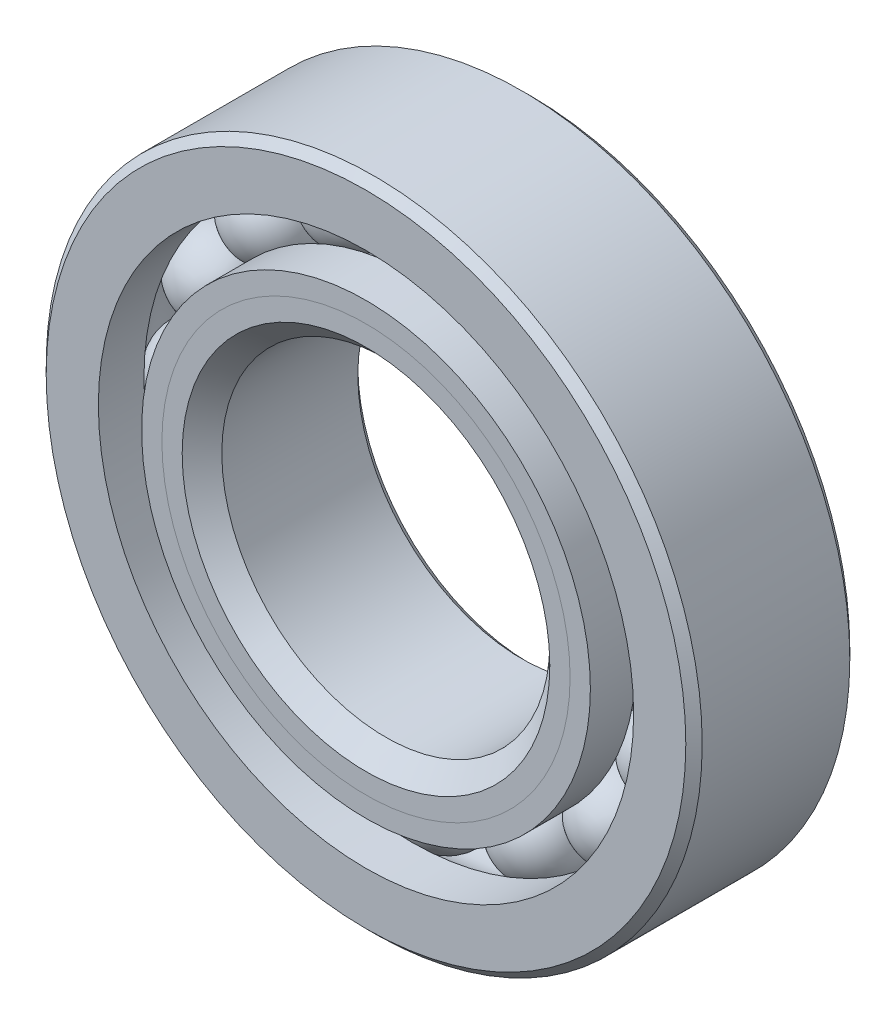
ISO-10303-21;
HEADER;
FILE_DESCRIPTION(('STEP AP214'),'2;1');
FILE_NAME('part.step','',(''),(''),'','','');
FILE_SCHEMA(('AUTOMOTIVE_DESIGN { 1 0 10303 214 1 1 1 1 }'));
ENDSEC;
DATA;
#1=APPLICATION_CONTEXT('core data for automotive mechanical design processes');
#2=APPLICATION_PROTOCOL_DEFINITION('international standard','automotive_design',2000,#1);
#3=PRODUCT_CONTEXT('',#1,'mechanical');
#4=PRODUCT('Part','Part','',(#3));
#5=PRODUCT_RELATED_PRODUCT_CATEGORY('part','',(#4));
#6=PRODUCT_DEFINITION_FORMATION('','',#4);
#7=PRODUCT_DEFINITION_CONTEXT('part definition',#1,'design');
#8=PRODUCT_DEFINITION('design','',#6,#7);
#9=PRODUCT_DEFINITION_SHAPE('','',#8);
#10=(LENGTH_UNIT() NAMED_UNIT(*) SI_UNIT(.MILLI.,.METRE.));
#11=(NAMED_UNIT(*) PLANE_ANGLE_UNIT() SI_UNIT($,.RADIAN.));
#12=(NAMED_UNIT(*) SI_UNIT($,.STERADIAN.) SOLID_ANGLE_UNIT());
#13=UNCERTAINTY_MEASURE_WITH_UNIT(LENGTH_MEASURE(1.E-05),#10,'distance_accuracy_value','');
#14=(GEOMETRIC_REPRESENTATION_CONTEXT(3) GLOBAL_UNCERTAINTY_ASSIGNED_CONTEXT((#13)) GLOBAL_UNIT_ASSIGNED_CONTEXT((#10,
#11,#12)) REPRESENTATION_CONTEXT('',''));
#15=CARTESIAN_POINT('',(0.,0.,0.));
#16=DIRECTION('',(0.,0.,1.));
#17=DIRECTION('',(1.,0.,0.));
#18=AXIS2_PLACEMENT_3D('',#15,#16,#17);
#19=CARTESIAN_POINT('',(-7.29011938655472,17.5999050943401,0.));
#20=DIRECTION('',(0.,0.,1.));
#21=DIRECTION('',(-0.382683432365077,0.923879532511292,0.));
#22=AXIS2_PLACEMENT_3D('',#19,#20,#21);
#23=SPHERICAL_SURFACE('',#22,3.28171342706955);
#24=CARTESIAN_POINT('',(-7.29011938655472,17.5999050943401,3.28171342706955));
#25=VERTEX_POINT('',#24);
#26=VERTEX_LOOP('',#25);
#27=FACE_BOUND('',#26,.T.);
#28=ADVANCED_FACE('F44',(#27),#23,.T.);
#29=CLOSED_SHELL('',(#28));
#30=MANIFOLD_SOLID_BREP('B2',#29);
#31=CARTESIAN_POINT('',(-13.4703841816036,13.4703841816039,0.));
#32=DIRECTION('',(0.,0.,1.));
#33=DIRECTION('',(-0.707106781186539,0.707106781186556,0.));
#34=AXIS2_PLACEMENT_3D('',#31,#32,#33);
#35=SPHERICAL_SURFACE('',#34,3.28171342706955);
#36=CARTESIAN_POINT('',(-13.4703841816036,13.4703841816039,3.28171342706955));
#37=VERTEX_POINT('',#36);
#38=VERTEX_LOOP('',#37);
#39=FACE_BOUND('',#38,.T.);
#40=ADVANCED_FACE('F77',(#39),#35,.T.);
#41=CLOSED_SHELL('',(#40));
#42=MANIFOLD_SOLID_BREP('B6',#41);
#43=CARTESIAN_POINT('',(-17.5999050943399,7.29011938655515,0.));
#44=DIRECTION('',(0.,0.,1.));
#45=DIRECTION('',(-0.923879532511283,0.3826834323651,0.));
#46=AXIS2_PLACEMENT_3D('',#43,#44,#45);
#47=SPHERICAL_SURFACE('',#46,3.28171342706955);
#48=CARTESIAN_POINT('',(-17.5999050943399,7.29011938655515,3.28171342706955));
#49=VERTEX_POINT('',#48);
#50=VERTEX_LOOP('',#49);
#51=FACE_BOUND('',#50,.T.);
#52=ADVANCED_FACE('F110',(#51),#47,.T.);
#53=CLOSED_SHELL('',(#52));
#54=MANIFOLD_SOLID_BREP('B40',#53);
#55=CARTESIAN_POINT('',(-19.05,1.99538158514885E-13,0.));
#56=DIRECTION('',(0.,0.,1.));
#57=DIRECTION('',(-1.,0.,0.));
#58=AXIS2_PLACEMENT_3D('',#55,#56,#57);
#59=SPHERICAL_SURFACE('',#58,3.28171342706955);
#60=CARTESIAN_POINT('',(-19.05,1.99538158514885E-13,3.28171342706955));
#61=VERTEX_POINT('',#60);
#62=VERTEX_LOOP('',#61);
#63=FACE_BOUND('',#62,.T.);
#64=ADVANCED_FACE('F143',(#63),#59,.T.);
#65=CLOSED_SHELL('',(#64));
#66=MANIFOLD_SOLID_BREP('B73',#65);
#67=CARTESIAN_POINT('',(-17.5999050943401,-7.29011938655478,0.));
#68=DIRECTION('',(0.,0.,1.));
#69=DIRECTION('',(-0.923879532511291,-0.382683432365081,0.));
#70=AXIS2_PLACEMENT_3D('',#67,#68,#69);
#71=SPHERICAL_SURFACE('',#70,3.28171342706955);
#72=CARTESIAN_POINT('',(-17.5999050943401,-7.29011938655478,3.28171342706955));
#73=VERTEX_POINT('',#72);
#74=VERTEX_LOOP('',#73);
#75=FACE_BOUND('',#74,.T.);
#76=ADVANCED_FACE('F176',(#75),#71,.T.);
#77=CLOSED_SHELL('',(#76));
#78=MANIFOLD_SOLID_BREP('B106',#77);
#79=CARTESIAN_POINT('',(-13.4703841816038,-13.4703841816036,0.));
#80=DIRECTION('',(0.,0.,1.));
#81=DIRECTION('',(-0.707106781186554,-0.707106781186541,0.));
#82=AXIS2_PLACEMENT_3D('',#79,#80,#81);
#83=SPHERICAL_SURFACE('',#82,3.28171342706955);
#84=CARTESIAN_POINT('',(-13.4703841816038,-13.4703841816036,3.28171342706955));
#85=VERTEX_POINT('',#84);
#86=VERTEX_LOOP('',#85);
#87=FACE_BOUND('',#86,.T.);
#88=ADVANCED_FACE('F209',(#87),#83,.T.);
#89=CLOSED_SHELL('',(#88));
#90=MANIFOLD_SOLID_BREP('B139',#89);
#91=CARTESIAN_POINT('',(-7.2901193865551,-17.59990509434,0.));
#92=DIRECTION('',(0.,0.,1.));
#93=DIRECTION('',(-0.382683432365097,-0.923879532511284,0.));
#94=AXIS2_PLACEMENT_3D('',#91,#92,#93);
#95=SPHERICAL_SURFACE('',#94,3.28171342706955);
#96=CARTESIAN_POINT('',(-7.2901193865551,-17.59990509434,3.28171342706955));
#97=VERTEX_POINT('',#96);
#98=VERTEX_LOOP('',#97);
#99=FACE_BOUND('',#98,.T.);
#100=ADVANCED_FACE('F242',(#99),#95,.T.);
#101=CLOSED_SHELL('',(#100));
#102=MANIFOLD_SOLID_BREP('B172',#101);
#103=CARTESIAN_POINT('',(-1.33025439009923E-13,-19.05,0.));
#104=DIRECTION('',(0.,0.,1.));
#105=DIRECTION('',(0.,-1.,0.));
#106=AXIS2_PLACEMENT_3D('',#103,#104,#105);
#107=SPHERICAL_SURFACE('',#106,3.28171342706955);
#108=CARTESIAN_POINT('',(-1.33025439009923E-13,-19.05,3.28171342706955));
#109=VERTEX_POINT('',#108);
#110=VERTEX_LOOP('',#109);
#111=FACE_BOUND('',#110,.T.);
#112=ADVANCED_FACE('F275',(#111),#107,.T.);
#113=CLOSED_SHELL('',(#112));
#114=MANIFOLD_SOLID_BREP('B205',#113);
#115=CARTESIAN_POINT('',(7.29011938655485,-17.5999050943401,0.));
#116=DIRECTION('',(0.,0.,1.));
#117=DIRECTION('',(0.382683432365084,-0.923879532511289,0.));
#118=AXIS2_PLACEMENT_3D('',#115,#116,#117);
#119=SPHERICAL_SURFACE('',#118,3.28171342706955);
#120=CARTESIAN_POINT('',(7.29011938655485,-17.5999050943401,3.28171342706955));
#121=VERTEX_POINT('',#120);
#122=VERTEX_LOOP('',#121);
#123=FACE_BOUND('',#122,.T.);
#124=ADVANCED_FACE('F308',(#123),#119,.T.);
#125=CLOSED_SHELL('',(#124));
#126=MANIFOLD_SOLID_BREP('B238',#125);
#127=CARTESIAN_POINT('',(13.4703841816037,-13.4703841816038,0.));
#128=DIRECTION('',(0.,0.,1.));
#129=DIRECTION('',(0.707106781186544,-0.707106781186551,0.));
#130=AXIS2_PLACEMENT_3D('',#127,#128,#129);
#131=SPHERICAL_SURFACE('',#130,3.28171342706955);
#132=CARTESIAN_POINT('',(13.4703841816037,-13.4703841816038,3.28171342706955));
#133=VERTEX_POINT('',#132);
#134=VERTEX_LOOP('',#133);
#135=FACE_BOUND('',#134,.T.);
#136=ADVANCED_FACE('F341',(#135),#131,.T.);
#137=CLOSED_SHELL('',(#136));
#138=MANIFOLD_SOLID_BREP('B271',#137);
#139=CARTESIAN_POINT('',(17.59990509434,-7.29011938655504,0.));
#140=DIRECTION('',(0.,0.,1.));
#141=DIRECTION('',(0.923879532511285,-0.382683432365094,0.));
#142=AXIS2_PLACEMENT_3D('',#139,#140,#141);
#143=SPHERICAL_SURFACE('',#142,3.28171342706955);
#144=CARTESIAN_POINT('',(17.59990509434,-7.29011938655504,3.28171342706955));
#145=VERTEX_POINT('',#144);
#146=VERTEX_LOOP('',#145);
#147=FACE_BOUND('',#146,.T.);
#148=ADVANCED_FACE('F374',(#147),#143,.T.);
#149=CLOSED_SHELL('',(#148));
#150=MANIFOLD_SOLID_BREP('B304',#149);
#151=CARTESIAN_POINT('',(19.05,0.,0.));
#152=DIRECTION('',(0.,0.,1.));
#153=DIRECTION('',(1.,0.,0.));
#154=AXIS2_PLACEMENT_3D('',#151,#152,#153);
#155=SPHERICAL_SURFACE('',#154,3.28171342706955);
#156=CARTESIAN_POINT('',(19.05,0.,3.28171342706955));
#157=VERTEX_POINT('',#156);
#158=VERTEX_LOOP('',#157);
#159=FACE_BOUND('',#158,.T.);
#160=ADVANCED_FACE('F407',(#159),#155,.T.);
#161=CLOSED_SHELL('',(#160));
#162=MANIFOLD_SOLID_BREP('B337',#161);
#163=CARTESIAN_POINT('',(17.59990509434,7.29011938655491,0.));
#164=DIRECTION('',(0.,0.,1.));
#165=DIRECTION('',(0.923879532511288,0.382683432365087,0.));
#166=AXIS2_PLACEMENT_3D('',#163,#164,#165);
#167=SPHERICAL_SURFACE('',#166,3.28171342706955);
#168=CARTESIAN_POINT('',(17.59990509434,7.29011938655491,3.28171342706955));
#169=VERTEX_POINT('',#168);
#170=VERTEX_LOOP('',#169);
#171=FACE_BOUND('',#170,.T.);
#172=ADVANCED_FACE('F440',(#171),#167,.T.);
#173=CLOSED_SHELL('',(#172));
#174=MANIFOLD_SOLID_BREP('B370',#173);
#175=CARTESIAN_POINT('',(13.4703841816038,13.4703841816037,0.));
#176=DIRECTION('',(0.,0.,1.));
#177=DIRECTION('',(0.707106781186549,0.707106781186546,0.));
#178=AXIS2_PLACEMENT_3D('',#175,#176,#177);
#179=SPHERICAL_SURFACE('',#178,3.28171342706955);
#180=CARTESIAN_POINT('',(13.4703841816038,13.4703841816037,3.28171342706955));
#181=VERTEX_POINT('',#180);
#182=VERTEX_LOOP('',#181);
#183=FACE_BOUND('',#182,.T.);
#184=ADVANCED_FACE('F473',(#183),#179,.T.);
#185=CLOSED_SHELL('',(#184));
#186=MANIFOLD_SOLID_BREP('B403',#185);
#187=CARTESIAN_POINT('',(7.29011938655498,17.59990509434,0.));
#188=DIRECTION('',(0.,0.,1.));
#189=DIRECTION('',(0.382683432365091,0.923879532511287,0.));
#190=AXIS2_PLACEMENT_3D('',#187,#188,#189);
#191=SPHERICAL_SURFACE('',#190,3.28171342706955);
#192=CARTESIAN_POINT('',(7.29011938655498,17.59990509434,3.28171342706955));
#193=VERTEX_POINT('',#192);
#194=VERTEX_LOOP('',#193);
#195=FACE_BOUND('',#194,.T.);
#196=ADVANCED_FACE('F506',(#195),#191,.T.);
#197=CLOSED_SHELL('',(#196));
#198=MANIFOLD_SOLID_BREP('B436',#197);
#199=CARTESIAN_POINT('',(0.,19.05,0.));
#200=DIRECTION('',(0.,0.,1.));
#201=DIRECTION('',(0.,1.,0.));
#202=AXIS2_PLACEMENT_3D('',#199,#200,#201);
#203=SPHERICAL_SURFACE('',#202,3.28171342706955);
#204=CARTESIAN_POINT('',(0.,19.05,3.28171342706955));
#205=VERTEX_POINT('',#204);
#206=VERTEX_LOOP('',#205);
#207=FACE_BOUND('',#206,.T.);
#208=ADVANCED_FACE('F541',(#207),#203,.T.);
#209=CLOSED_SHELL('',(#208));
#210=MANIFOLD_SOLID_BREP('B469',#209);
#211=CARTESIAN_POINT('',(0.,15.80470900587,6.35));
#212=DIRECTION('',(0.,0.,-1.));
#213=DIRECTION('',(-1.,0.,0.));
#214=AXIS2_PLACEMENT_3D('',#211,#212,#213);
#215=PLANE('',#214);
#216=CARTESIAN_POINT('',(0.,0.,6.35));
#217=DIRECTION('',(0.,0.,1.));
#218=DIRECTION('',(1.,0.,0.));
#219=AXIS2_PLACEMENT_3D('',#216,#217,#218);
#220=CIRCLE('',#219,14.2341432864652);
#221=CARTESIAN_POINT('',(14.2341432864652,0.,6.35));
#222=VERTEX_POINT('',#221);
#223=EDGE_CURVE('E601',#222,#222,#220,.T.);
#224=ORIENTED_EDGE('',*,*,#223,.F.);
#225=EDGE_LOOP('',(#224));
#226=FACE_BOUND('',#225,.T.);
#227=CARTESIAN_POINT('',(0.,0.,6.35));
#228=DIRECTION('',(0.,0.,1.));
#229=DIRECTION('',(1.,0.,0.));
#230=AXIS2_PLACEMENT_3D('',#227,#228,#229);
#231=CIRCLE('',#230,15.80470900587);
#232=CARTESIAN_POINT('',(15.80470900587,0.,6.35));
#233=VERTEX_POINT('',#232);
#234=EDGE_CURVE('E540',#233,#233,#231,.T.);
#235=ORIENTED_EDGE('',*,*,#234,.T.);
#236=EDGE_LOOP('',(#235));
#237=FACE_BOUND('',#236,.T.);
#238=ADVANCED_FACE('F562',(#226,#237),#215,.F.);
#239=CARTESIAN_POINT('',(0.,0.,4.77943428059526));
#240=DIRECTION('',(0.,0.,1.));
#241=DIRECTION('',(1.,0.,0.));
#242=AXIS2_PLACEMENT_3D('',#239,#240,#241);
#243=CONICAL_SURFACE('',#242,14.2341432864652,0.78539816339745);
#244=ORIENTED_EDGE('',*,*,#234,.F.);
#245=EDGE_LOOP('',(#244));
#246=FACE_BOUND('',#245,.T.);
#247=CARTESIAN_POINT('',(0.,0.,4.77943428059526));
#248=DIRECTION('',(0.,0.,1.));
#249=DIRECTION('',(1.,0.,0.));
#250=AXIS2_PLACEMENT_3D('',#247,#248,#249);
#251=CIRCLE('',#250,14.2341432864652);
#252=CARTESIAN_POINT('',(14.2341432864652,0.,4.77943428059526));
#253=VERTEX_POINT('',#252);
#254=EDGE_CURVE('E568',#253,#253,#251,.T.);
#255=ORIENTED_EDGE('',*,*,#254,.T.);
#256=EDGE_LOOP('',(#255));
#257=FACE_BOUND('',#256,.T.);
#258=ADVANCED_FACE('F608',(#246,#257),#243,.T.);
#259=CARTESIAN_POINT('',(0.,0.,6.35));
#260=DIRECTION('',(0.,0.,1.));
#261=DIRECTION('',(1.,0.,0.));
#262=AXIS2_PLACEMENT_3D('',#259,#260,#261);
#263=CYLINDRICAL_SURFACE('',#262,14.2341432864652);
#264=ORIENTED_EDGE('',*,*,#254,.F.);
#265=EDGE_LOOP('',(#264));
#266=FACE_BOUND('',#265,.T.);
#267=CARTESIAN_POINT('',(0.,0.,0.));
#268=DIRECTION('',(0.,0.,1.));
#269=DIRECTION('',(1.,0.,0.));
#270=AXIS2_PLACEMENT_3D('',#267,#268,#269);
#271=CIRCLE('',#270,14.2341432864652);
#272=CARTESIAN_POINT('',(14.2341432864652,0.,0.));
#273=VERTEX_POINT('',#272);
#274=EDGE_CURVE('E572',#273,#273,#271,.T.);
#275=ORIENTED_EDGE('',*,*,#274,.T.);
#276=EDGE_LOOP('',(#275));
#277=FACE_BOUND('',#276,.T.);
#278=ADVANCED_FACE('F612',(#266,#277),#263,.T.);
#279=CARTESIAN_POINT('',(0.,14.2341432864652,0.));
#280=DIRECTION('',(0.,0.,-1.));
#281=DIRECTION('',(-1.,0.,0.));
#282=AXIS2_PLACEMENT_3D('',#279,#280,#281);
#283=PLANE('',#282);
#284=ORIENTED_EDGE('',*,*,#274,.F.);
#285=EDGE_LOOP('',(#284));
#286=FACE_BOUND('',#285,.T.);
#287=CARTESIAN_POINT('',(0.,0.,0.));
#288=DIRECTION('',(0.,0.,1.));
#289=DIRECTION('',(1.,0.,0.));
#290=AXIS2_PLACEMENT_3D('',#287,#288,#289);
#291=CIRCLE('',#290,15.7682865729304);
#292=CARTESIAN_POINT('',(15.7682865729304,0.,0.));
#293=VERTEX_POINT('',#292);
#294=EDGE_CURVE('E577',#293,#293,#291,.T.);
#295=ORIENTED_EDGE('',*,*,#294,.T.);
#296=EDGE_LOOP('',(#295));
#297=FACE_BOUND('',#296,.T.);
#298=ADVANCED_FACE('F617',(#286,#297),#283,.F.);
#299=CARTESIAN_POINT('',(0.,0.,0.));
#300=DIRECTION('',(0.,0.,1.));
#301=DIRECTION('',(1.,0.,0.));
#302=AXIS2_PLACEMENT_3D('',#299,#300,#301);
#303=TOROIDAL_SURFACE('',#302,19.05,3.28171342706955);
#304=ORIENTED_EDGE('',*,*,#294,.F.);
#305=EDGE_LOOP('',(#304));
#306=FACE_BOUND('',#305,.T.);
#307=CARTESIAN_POINT('',(0.,0.,-2.82222222222222));
#308=DIRECTION('',(0.,0.,1.));
#309=DIRECTION('',(1.,0.,0.));
#310=AXIS2_PLACEMENT_3D('',#307,#308,#309);
#311=CIRCLE('',#310,17.3752747252747);
#312=CARTESIAN_POINT('',(17.3752747252747,0.,-2.82222222222222));
#313=VERTEX_POINT('',#312);
#314=EDGE_CURVE('E583',#313,#313,#311,.T.);
#315=ORIENTED_EDGE('',*,*,#314,.T.);
#316=EDGE_LOOP('',(#315));
#317=FACE_BOUND('',#316,.T.);
#318=ADVANCED_FACE('F623',(#306,#317),#303,.F.);
#319=CARTESIAN_POINT('',(0.,0.,6.35));
#320=DIRECTION('',(0.,0.,1.));
#321=DIRECTION('',(1.,0.,0.));
#322=AXIS2_PLACEMENT_3D('',#319,#320,#321);
#323=CYLINDRICAL_SURFACE('',#322,17.3752747252747);
#324=ORIENTED_EDGE('',*,*,#314,.F.);
#325=EDGE_LOOP('',(#324));
#326=FACE_BOUND('',#325,.T.);
#327=CARTESIAN_POINT('',(0.,0.,-6.35));
#328=DIRECTION('',(0.,0.,1.));
#329=DIRECTION('',(1.,0.,0.));
#330=AXIS2_PLACEMENT_3D('',#327,#328,#329);
#331=CIRCLE('',#330,17.3752747252747);
#332=CARTESIAN_POINT('',(17.3752747252747,0.,-6.35));
#333=VERTEX_POINT('',#332);
#334=EDGE_CURVE('E587',#333,#333,#331,.T.);
#335=ORIENTED_EDGE('',*,*,#334,.T.);
#336=EDGE_LOOP('',(#335));
#337=FACE_BOUND('',#336,.T.);
#338=ADVANCED_FACE('F627',(#326,#337),#323,.T.);
#339=CARTESIAN_POINT('',(0.,13.335,-6.35));
#340=DIRECTION('',(0.,0.,1.));
#341=DIRECTION('',(1.,0.,0.));
#342=AXIS2_PLACEMENT_3D('',#339,#340,#341);
#343=PLANE('',#342);
#344=ORIENTED_EDGE('',*,*,#334,.F.);
#345=EDGE_LOOP('',(#344));
#346=FACE_BOUND('',#345,.T.);
#347=CARTESIAN_POINT('',(0.,0.,-6.35));
#348=DIRECTION('',(0.,0.,1.));
#349=DIRECTION('',(1.,0.,0.));
#350=AXIS2_PLACEMENT_3D('',#347,#348,#349);
#351=CIRCLE('',#350,13.335);
#352=CARTESIAN_POINT('',(13.335,0.,-6.35));
#353=VERTEX_POINT('',#352);
#354=EDGE_CURVE('E591',#353,#353,#351,.T.);
#355=ORIENTED_EDGE('',*,*,#354,.T.);
#356=EDGE_LOOP('',(#355));
#357=FACE_BOUND('',#356,.T.);
#358=ADVANCED_FACE('F631',(#346,#357),#343,.F.);
#359=CARTESIAN_POINT('',(0.,0.,-5.715));
#360=DIRECTION('',(0.,0.,-1.));
#361=DIRECTION('',(-1.,0.,0.));
#362=AXIS2_PLACEMENT_3D('',#359,#360,#361);
#363=CONICAL_SURFACE('',#362,12.7,0.785398163397444);
#364=ORIENTED_EDGE('',*,*,#354,.F.);
#365=EDGE_LOOP('',(#364));
#366=FACE_BOUND('',#365,.T.);
#367=CARTESIAN_POINT('',(0.,0.,-5.715));
#368=DIRECTION('',(0.,0.,1.));
#369=DIRECTION('',(1.,0.,0.));
#370=AXIS2_PLACEMENT_3D('',#367,#368,#369);
#371=CIRCLE('',#370,12.7);
#372=CARTESIAN_POINT('',(12.7,0.,-5.715));
#373=VERTEX_POINT('',#372);
#374=EDGE_CURVE('E594',#373,#373,#371,.T.);
#375=ORIENTED_EDGE('',*,*,#374,.T.);
#376=EDGE_LOOP('',(#375));
#377=FACE_BOUND('',#376,.T.);
#378=ADVANCED_FACE('F635',(#366,#377),#363,.F.);
#379=CARTESIAN_POINT('',(0.,0.,6.35));
#380=DIRECTION('',(0.,0.,1.));
#381=DIRECTION('',(1.,0.,0.));
#382=AXIS2_PLACEMENT_3D('',#379,#380,#381);
#383=CYLINDRICAL_SURFACE('',#382,12.7);
#384=ORIENTED_EDGE('',*,*,#374,.F.);
#385=EDGE_LOOP('',(#384));
#386=FACE_BOUND('',#385,.T.);
#387=CARTESIAN_POINT('',(0.,0.,4.81585671353479));
#388=DIRECTION('',(0.,0.,1.));
#389=DIRECTION('',(1.,0.,0.));
#390=AXIS2_PLACEMENT_3D('',#387,#388,#389);
#391=CIRCLE('',#390,12.7);
#392=CARTESIAN_POINT('',(12.7,0.,4.81585671353479));
#393=VERTEX_POINT('',#392);
#394=EDGE_CURVE('E597',#393,#393,#391,.T.);
#395=ORIENTED_EDGE('',*,*,#394,.T.);
#396=EDGE_LOOP('',(#395));
#397=FACE_BOUND('',#396,.T.);
#398=ADVANCED_FACE('F639',(#386,#397),#383,.F.);
#399=CARTESIAN_POINT('',(0.,0.,6.35));
#400=DIRECTION('',(0.,0.,1.));
#401=DIRECTION('',(1.,0.,0.));
#402=AXIS2_PLACEMENT_3D('',#399,#400,#401);
#403=CONICAL_SURFACE('',#402,14.2341432864652,0.78539816339745);
#404=ORIENTED_EDGE('',*,*,#394,.F.);
#405=EDGE_LOOP('',(#404));
#406=FACE_BOUND('',#405,.T.);
#407=ORIENTED_EDGE('',*,*,#223,.T.);
#408=EDGE_LOOP('',(#407));
#409=FACE_BOUND('',#408,.T.);
#410=ADVANCED_FACE('F605',(#406,#409),#403,.F.);
#411=CLOSED_SHELL('',(#238,#258,#278,#298,#318,#338,#358,#378,#398,#410));
#412=MANIFOLD_SOLID_BREP('B502',#411);
#413=CARTESIAN_POINT('',(0.,17.3752747252747,6.35));
#414=DIRECTION('',(0.,0.,-1.));
#415=DIRECTION('',(-1.,0.,0.));
#416=AXIS2_PLACEMENT_3D('',#413,#414,#415);
#417=PLANE('',#416);
#418=CARTESIAN_POINT('',(0.,0.,6.35));
#419=DIRECTION('',(0.,0.,1.));
#420=DIRECTION('',(1.,0.,0.));
#421=AXIS2_PLACEMENT_3D('',#418,#419,#420);
#422=CIRCLE('',#421,15.80470900587);
#423=CARTESIAN_POINT('',(15.80470900587,0.,6.35));
#424=VERTEX_POINT('',#423);
#425=EDGE_CURVE('E561',#424,#424,#422,.T.);
#426=ORIENTED_EDGE('',*,*,#425,.F.);
#427=EDGE_LOOP('',(#426));
#428=FACE_BOUND('',#427,.T.);
#429=CARTESIAN_POINT('',(0.,0.,6.35));
#430=DIRECTION('',(0.,0.,1.));
#431=DIRECTION('',(1.,0.,0.));
#432=AXIS2_PLACEMENT_3D('',#429,#430,#431);
#433=CIRCLE('',#432,17.3752747252747);
#434=CARTESIAN_POINT('',(17.3752747252747,0.,6.35));
#435=VERTEX_POINT('',#434);
#436=EDGE_CURVE('E752',#435,#435,#433,.T.);
#437=ORIENTED_EDGE('',*,*,#436,.T.);
#438=EDGE_LOOP('',(#437));
#439=FACE_BOUND('',#438,.T.);
#440=ADVANCED_FACE('F728',(#428,#439),#417,.F.);
#441=CARTESIAN_POINT('',(0.,0.,6.35));
#442=DIRECTION('',(0.,0.,1.));
#443=DIRECTION('',(1.,0.,0.));
#444=AXIS2_PLACEMENT_3D('',#441,#442,#443);
#445=CONICAL_SURFACE('',#444,15.80470900587,0.78539816339745);
#446=CARTESIAN_POINT('',(0.,0.,4.77943428059526));
#447=DIRECTION('',(0.,0.,1.));
#448=DIRECTION('',(1.,0.,0.));
#449=AXIS2_PLACEMENT_3D('',#446,#447,#448);
#450=CIRCLE('',#449,14.2341432864652);
#451=CARTESIAN_POINT('',(14.2341432864652,0.,4.77943428059526));
#452=VERTEX_POINT('',#451);
#453=EDGE_CURVE('E734',#452,#452,#450,.T.);
#454=ORIENTED_EDGE('',*,*,#453,.F.);
#455=EDGE_LOOP('',(#454));
#456=FACE_BOUND('',#455,.T.);
#457=ORIENTED_EDGE('',*,*,#425,.T.);
#458=EDGE_LOOP('',(#457));
#459=FACE_BOUND('',#458,.T.);
#460=ADVANCED_FACE('F777',(#456,#459),#445,.F.);
#461=CARTESIAN_POINT('',(0.,0.,6.35));
#462=DIRECTION('',(0.,0.,1.));
#463=DIRECTION('',(1.,0.,0.));
#464=AXIS2_PLACEMENT_3D('',#461,#462,#463);
#465=CYLINDRICAL_SURFACE('',#464,14.2341432864652);
#466=CARTESIAN_POINT('',(0.,0.,0.));
#467=DIRECTION('',(0.,0.,1.));
#468=DIRECTION('',(1.,0.,0.));
#469=AXIS2_PLACEMENT_3D('',#466,#467,#468);
#470=CIRCLE('',#469,14.2341432864652);
#471=CARTESIAN_POINT('',(14.2341432864652,0.,0.));
#472=VERTEX_POINT('',#471);
#473=EDGE_CURVE('E738',#472,#472,#470,.T.);
#474=ORIENTED_EDGE('',*,*,#473,.F.);
#475=EDGE_LOOP('',(#474));
#476=FACE_BOUND('',#475,.T.);
#477=ORIENTED_EDGE('',*,*,#453,.T.);
#478=EDGE_LOOP('',(#477));
#479=FACE_BOUND('',#478,.T.);
#480=ADVANCED_FACE('F772',(#476,#479),#465,.F.);
#481=CARTESIAN_POINT('',(0.,14.2341432864652,0.));
#482=DIRECTION('',(0.,0.,1.));
#483=DIRECTION('',(1.,0.,0.));
#484=AXIS2_PLACEMENT_3D('',#481,#482,#483);
#485=PLANE('',#484);
#486=CARTESIAN_POINT('',(0.,0.,0.));
#487=DIRECTION('',(0.,0.,1.));
#488=DIRECTION('',(1.,0.,0.));
#489=AXIS2_PLACEMENT_3D('',#486,#487,#488);
#490=CIRCLE('',#489,15.7682865729304);
#491=CARTESIAN_POINT('',(15.7682865729304,0.,0.));
#492=VERTEX_POINT('',#491);
#493=EDGE_CURVE('E743',#492,#492,#490,.T.);
#494=ORIENTED_EDGE('',*,*,#493,.F.);
#495=EDGE_LOOP('',(#494));
#496=FACE_BOUND('',#495,.T.);
#497=ORIENTED_EDGE('',*,*,#473,.T.);
#498=EDGE_LOOP('',(#497));
#499=FACE_BOUND('',#498,.T.);
#500=ADVANCED_FACE('F766',(#496,#499),#485,.F.);
#501=CARTESIAN_POINT('',(0.,0.,0.));
#502=DIRECTION('',(0.,0.,1.));
#503=DIRECTION('',(1.,0.,0.));
#504=AXIS2_PLACEMENT_3D('',#501,#502,#503);
#505=TOROIDAL_SURFACE('',#504,19.05,3.28171342706955);
#506=CARTESIAN_POINT('',(0.,0.,2.82222222222222));
#507=DIRECTION('',(0.,0.,1.));
#508=DIRECTION('',(1.,0.,0.));
#509=AXIS2_PLACEMENT_3D('',#506,#507,#508);
#510=CIRCLE('',#509,17.3752747252747);
#511=CARTESIAN_POINT('',(17.3752747252747,0.,2.82222222222222));
#512=VERTEX_POINT('',#511);
#513=EDGE_CURVE('E749',#512,#512,#510,.T.);
#514=ORIENTED_EDGE('',*,*,#513,.F.);
#515=EDGE_LOOP('',(#514));
#516=FACE_BOUND('',#515,.T.);
#517=ORIENTED_EDGE('',*,*,#493,.T.);
#518=EDGE_LOOP('',(#517));
#519=FACE_BOUND('',#518,.T.);
#520=ADVANCED_FACE('F760',(#516,#519),#505,.F.);
#521=CARTESIAN_POINT('',(0.,0.,6.35));
#522=DIRECTION('',(0.,0.,1.));
#523=DIRECTION('',(1.,0.,0.));
#524=AXIS2_PLACEMENT_3D('',#521,#522,#523);
#525=CYLINDRICAL_SURFACE('',#524,17.3752747252747);
#526=ORIENTED_EDGE('',*,*,#436,.F.);
#527=EDGE_LOOP('',(#526));
#528=FACE_BOUND('',#527,.T.);
#529=ORIENTED_EDGE('',*,*,#513,.T.);
#530=EDGE_LOOP('',(#529));
#531=FACE_BOUND('',#530,.T.);
#532=ADVANCED_FACE('F757',(#528,#531),#525,.T.);
#533=CLOSED_SHELL('',(#440,#460,#480,#500,#520,#532));
#534=MANIFOLD_SOLID_BREP('B535',#533);
#535=CARTESIAN_POINT('',(0.,0.,5.715));
#536=DIRECTION('',(0.,0.,-1.));
#537=DIRECTION('',(-1.,0.,0.));
#538=AXIS2_PLACEMENT_3D('',#535,#536,#537);
#539=CONICAL_SURFACE('',#538,25.4,0.785398163397446);
#540=CARTESIAN_POINT('',(0.,0.,6.35));
#541=DIRECTION('',(0.,0.,1.));
#542=DIRECTION('',(1.,0.,0.));
#543=AXIS2_PLACEMENT_3D('',#540,#541,#542);
#544=CIRCLE('',#543,24.765);
#545=CARTESIAN_POINT('',(24.765,0.,6.35));
#546=VERTEX_POINT('',#545);
#547=EDGE_CURVE('E854',#546,#546,#544,.T.);
#548=ORIENTED_EDGE('',*,*,#547,.F.);
#549=EDGE_LOOP('',(#548));
#550=FACE_BOUND('',#549,.T.);
#551=CARTESIAN_POINT('',(0.,0.,5.715));
#552=DIRECTION('',(0.,0.,1.));
#553=DIRECTION('',(1.,0.,0.));
#554=AXIS2_PLACEMENT_3D('',#551,#552,#553);
#555=CIRCLE('',#554,25.4);
#556=CARTESIAN_POINT('',(25.4,0.,5.715));
#557=VERTEX_POINT('',#556);
#558=EDGE_CURVE('E727',#557,#557,#555,.T.);
#559=ORIENTED_EDGE('',*,*,#558,.T.);
#560=EDGE_LOOP('',(#559));
#561=FACE_BOUND('',#560,.T.);
#562=ADVANCED_FACE('F822',(#550,#561),#539,.T.);
#563=CARTESIAN_POINT('',(0.,0.,6.35));
#564=DIRECTION('',(0.,0.,1.));
#565=DIRECTION('',(1.,0.,0.));
#566=AXIS2_PLACEMENT_3D('',#563,#564,#565);
#567=CYLINDRICAL_SURFACE('',#566,25.4);
#568=ORIENTED_EDGE('',*,*,#558,.F.);
#569=EDGE_LOOP('',(#568));
#570=FACE_BOUND('',#569,.T.);
#571=CARTESIAN_POINT('',(0.,0.,-5.715));
#572=DIRECTION('',(0.,0.,1.));
#573=DIRECTION('',(1.,0.,0.));
#574=AXIS2_PLACEMENT_3D('',#571,#572,#573);
#575=CIRCLE('',#574,25.4);
#576=CARTESIAN_POINT('',(25.4,0.,-5.715));
#577=VERTEX_POINT('',#576);
#578=EDGE_CURVE('E828',#577,#577,#575,.T.);
#579=ORIENTED_EDGE('',*,*,#578,.T.);
#580=EDGE_LOOP('',(#579));
#581=FACE_BOUND('',#580,.T.);
#582=ADVANCED_FACE('F861',(#570,#581),#567,.T.);
#583=CARTESIAN_POINT('',(0.,0.,-6.35));
#584=DIRECTION('',(0.,0.,1.));
#585=DIRECTION('',(1.,0.,0.));
#586=AXIS2_PLACEMENT_3D('',#583,#584,#585);
#587=CONICAL_SURFACE('',#586,24.765,0.785398163397446);
#588=ORIENTED_EDGE('',*,*,#578,.F.);
#589=EDGE_LOOP('',(#588));
#590=FACE_BOUND('',#589,.T.);
#591=CARTESIAN_POINT('',(0.,0.,-6.35));
#592=DIRECTION('',(0.,0.,1.));
#593=DIRECTION('',(1.,0.,0.));
#594=AXIS2_PLACEMENT_3D('',#591,#592,#593);
#595=CIRCLE('',#594,24.765);
#596=CARTESIAN_POINT('',(24.765,0.,-6.35));
#597=VERTEX_POINT('',#596);
#598=EDGE_CURVE('E833',#597,#597,#595,.T.);
#599=ORIENTED_EDGE('',*,*,#598,.T.);
#600=EDGE_LOOP('',(#599));
#601=FACE_BOUND('',#600,.T.);
#602=ADVANCED_FACE('F865',(#590,#601),#587,.T.);
#603=CARTESIAN_POINT('',(0.,24.765,-6.35));
#604=DIRECTION('',(0.,0.,1.));
#605=DIRECTION('',(1.,0.,0.));
#606=AXIS2_PLACEMENT_3D('',#603,#604,#605);
#607=PLANE('',#606);
#608=ORIENTED_EDGE('',*,*,#598,.F.);
#609=EDGE_LOOP('',(#608));
#610=FACE_BOUND('',#609,.T.);
#611=CARTESIAN_POINT('',(0.,0.,-6.35));
#612=DIRECTION('',(0.,0.,1.));
#613=DIRECTION('',(1.,0.,0.));
#614=AXIS2_PLACEMENT_3D('',#611,#612,#613);
#615=CIRCLE('',#614,20.7247252747253);
#616=CARTESIAN_POINT('',(20.7247252747253,0.,-6.35));
#617=VERTEX_POINT('',#616);
#618=EDGE_CURVE('E838',#617,#617,#615,.T.);
#619=ORIENTED_EDGE('',*,*,#618,.T.);
#620=EDGE_LOOP('',(#619));
#621=FACE_BOUND('',#620,.T.);
#622=ADVANCED_FACE('F870',(#610,#621),#607,.F.);
#623=CARTESIAN_POINT('',(0.,0.,6.35));
#624=DIRECTION('',(0.,0.,1.));
#625=DIRECTION('',(1.,0.,0.));
#626=AXIS2_PLACEMENT_3D('',#623,#624,#625);
#627=CYLINDRICAL_SURFACE('',#626,20.7247252747253);
#628=ORIENTED_EDGE('',*,*,#618,.F.);
#629=EDGE_LOOP('',(#628));
#630=FACE_BOUND('',#629,.T.);
#631=CARTESIAN_POINT('',(0.,0.,-2.82222222222222));
#632=DIRECTION('',(0.,0.,1.));
#633=DIRECTION('',(1.,0.,0.));
#634=AXIS2_PLACEMENT_3D('',#631,#632,#633);
#635=CIRCLE('',#634,20.7247252747253);
#636=CARTESIAN_POINT('',(20.7247252747253,0.,-2.82222222222222));
#637=VERTEX_POINT('',#636);
#638=EDGE_CURVE('E844',#637,#637,#635,.T.);
#639=ORIENTED_EDGE('',*,*,#638,.T.);
#640=EDGE_LOOP('',(#639));
#641=FACE_BOUND('',#640,.T.);
#642=ADVANCED_FACE('F876',(#630,#641),#627,.F.);
#643=CARTESIAN_POINT('',(0.,0.,0.));
#644=DIRECTION('',(0.,0.,1.));
#645=DIRECTION('',(1.,0.,0.));
#646=AXIS2_PLACEMENT_3D('',#643,#644,#645);
#647=TOROIDAL_SURFACE('',#646,19.05,3.28171342706955);
#648=ORIENTED_EDGE('',*,*,#638,.F.);
#649=EDGE_LOOP('',(#648));
#650=FACE_BOUND('',#649,.T.);
#651=CARTESIAN_POINT('',(0.,0.,2.82222222222222));
#652=DIRECTION('',(0.,0.,1.));
#653=DIRECTION('',(1.,0.,0.));
#654=AXIS2_PLACEMENT_3D('',#651,#652,#653);
#655=CIRCLE('',#654,20.7247252747253);
#656=CARTESIAN_POINT('',(20.7247252747253,0.,2.82222222222222));
#657=VERTEX_POINT('',#656);
#658=EDGE_CURVE('E848',#657,#657,#655,.T.);
#659=ORIENTED_EDGE('',*,*,#658,.T.);
#660=EDGE_LOOP('',(#659));
#661=FACE_BOUND('',#660,.T.);
#662=ADVANCED_FACE('F880',(#650,#661),#647,.F.);
#663=CARTESIAN_POINT('',(0.,0.,6.35));
#664=DIRECTION('',(0.,0.,1.));
#665=DIRECTION('',(1.,0.,0.));
#666=AXIS2_PLACEMENT_3D('',#663,#664,#665);
#667=CYLINDRICAL_SURFACE('',#666,20.7247252747253);
#668=ORIENTED_EDGE('',*,*,#658,.F.);
#669=EDGE_LOOP('',(#668));
#670=FACE_BOUND('',#669,.T.);
#671=CARTESIAN_POINT('',(0.,0.,6.35));
#672=DIRECTION('',(0.,0.,1.));
#673=DIRECTION('',(1.,0.,0.));
#674=AXIS2_PLACEMENT_3D('',#671,#672,#673);
#675=CIRCLE('',#674,20.7247252747253);
#676=CARTESIAN_POINT('',(20.7247252747253,0.,6.35));
#677=VERTEX_POINT('',#676);
#678=EDGE_CURVE('E851',#677,#677,#675,.T.);
#679=ORIENTED_EDGE('',*,*,#678,.T.);
#680=EDGE_LOOP('',(#679));
#681=FACE_BOUND('',#680,.T.);
#682=ADVANCED_FACE('F884',(#670,#681),#667,.F.);
#683=CARTESIAN_POINT('',(0.,24.765,6.35));
#684=DIRECTION('',(0.,0.,-1.));
#685=DIRECTION('',(-1.,0.,0.));
#686=AXIS2_PLACEMENT_3D('',#683,#684,#685);
#687=PLANE('',#686);
#688=ORIENTED_EDGE('',*,*,#678,.F.);
#689=EDGE_LOOP('',(#688));
#690=FACE_BOUND('',#689,.T.);
#691=ORIENTED_EDGE('',*,*,#547,.T.);
#692=EDGE_LOOP('',(#691));
#693=FACE_BOUND('',#692,.T.);
#694=ADVANCED_FACE('F858',(#690,#693),#687,.F.);
#695=CLOSED_SHELL('',(#562,#582,#602,#622,#642,#662,#682,#694));
#696=MANIFOLD_SOLID_BREP('B556',#695);
#697=ADVANCED_BREP_SHAPE_REPRESENTATION('',(#18,#30,#42,#54,#66,#78,#90,#102,#114,#126,#138,
#150,#162,#174,#186,#198,#210,#412,#534,#696),#14);
#698=SHAPE_DEFINITION_REPRESENTATION(#9,#697);
ENDSEC;
END-ISO-10303-21;
